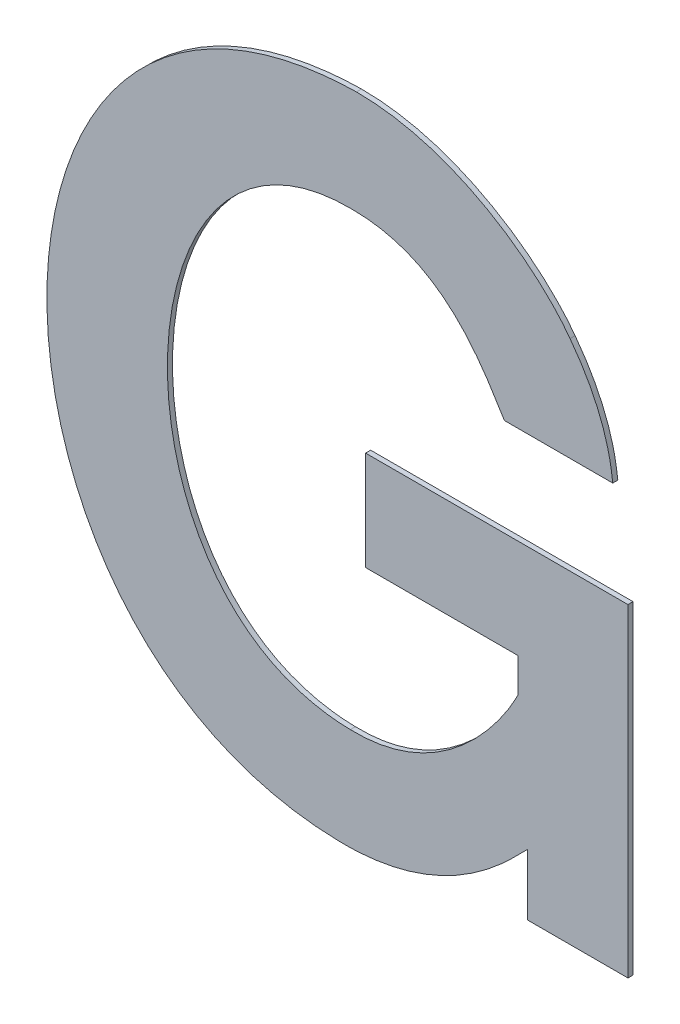
ISO-10303-21;
HEADER;
FILE_DESCRIPTION(('STEP AP214'),'2;1');
FILE_NAME('part.step','',(''),(''),'','','');
FILE_SCHEMA(('AUTOMOTIVE_DESIGN { 1 0 10303 214 1 1 1 1 }'));
ENDSEC;
DATA;
#1=APPLICATION_CONTEXT('core data for automotive mechanical design processes');
#2=APPLICATION_PROTOCOL_DEFINITION('international standard','automotive_design',2000,#1);
#3=PRODUCT_CONTEXT('',#1,'mechanical');
#4=PRODUCT('Part','Part','',(#3));
#5=PRODUCT_RELATED_PRODUCT_CATEGORY('part','',(#4));
#6=PRODUCT_DEFINITION_FORMATION('','',#4);
#7=PRODUCT_DEFINITION_CONTEXT('part definition',#1,'design');
#8=PRODUCT_DEFINITION('design','',#6,#7);
#9=PRODUCT_DEFINITION_SHAPE('','',#8);
#10=(LENGTH_UNIT() NAMED_UNIT(*) SI_UNIT(.MILLI.,.METRE.));
#11=(NAMED_UNIT(*) PLANE_ANGLE_UNIT() SI_UNIT($,.RADIAN.));
#12=(NAMED_UNIT(*) SI_UNIT($,.STERADIAN.) SOLID_ANGLE_UNIT());
#13=UNCERTAINTY_MEASURE_WITH_UNIT(LENGTH_MEASURE(1.E-05),#10,'distance_accuracy_value','');
#14=(GEOMETRIC_REPRESENTATION_CONTEXT(3) GLOBAL_UNCERTAINTY_ASSIGNED_CONTEXT((#13)) GLOBAL_UNIT_ASSIGNED_CONTEXT((#10,
#11,#12)) REPRESENTATION_CONTEXT('',''));
#15=CARTESIAN_POINT('',(0.,0.,0.));
#16=DIRECTION('',(0.,0.,1.));
#17=DIRECTION('',(1.,0.,0.));
#18=AXIS2_PLACEMENT_3D('',#15,#16,#17);
#19=CARTESIAN_POINT('',(-0.0539079148512999,0.042098390387646,0.00086146168299));
#20=DIRECTION('',(-1.,0.,0.));
#21=DIRECTION('',(0.,0.,1.));
#22=AXIS2_PLACEMENT_3D('',#19,#20,#21);
#23=PLANE('',#22);
#24=DIRECTION('',(0.,0.,1.));
#25=VECTOR('',#24,1.);
#26=CARTESIAN_POINT('',(-0.0539079148512999,0.034866638035092,-0.00033853831701));
#27=LINE('',#26,#25);
#28=CARTESIAN_POINT('',(-0.0539079148512999,0.034866638035092,-0.00033853831701));
#29=VERTEX_POINT('',#28);
#30=CARTESIAN_POINT('',(-0.0539079148512999,0.034866638035092,0.00086146168299));
#31=VERTEX_POINT('',#30);
#32=EDGE_CURVE('E11',#29,#31,#27,.T.);
#33=ORIENTED_EDGE('',*,*,#32,.T.);
#34=DIRECTION('',(0.,1.,0.));
#35=VECTOR('',#34,1.);
#36=CARTESIAN_POINT('',(-0.0539079148512999,0.034866638035092,0.00086146168299));
#37=LINE('',#36,#35);
#38=CARTESIAN_POINT('',(-0.0539079148512999,0.0493301427402,0.00086146168299));
#39=VERTEX_POINT('',#38);
#40=EDGE_CURVE('E24',#31,#39,#37,.T.);
#41=ORIENTED_EDGE('',*,*,#40,.T.);
#42=DIRECTION('',(0.,0.,1.));
#43=VECTOR('',#42,1.);
#44=CARTESIAN_POINT('',(-0.0539079148512999,0.0493301427402,-0.00033853831701));
#45=LINE('',#44,#43);
#46=CARTESIAN_POINT('',(-0.0539079148512999,0.0493301427402,-0.00033853831701));
#47=VERTEX_POINT('',#46);
#48=EDGE_CURVE('E348',#47,#39,#45,.T.);
#49=ORIENTED_EDGE('',*,*,#48,.F.);
#50=DIRECTION('',(0.,1.,0.));
#51=VECTOR('',#50,1.);
#52=CARTESIAN_POINT('',(-0.0539079148512999,0.034866638035092,-0.00033853831701));
#53=LINE('',#52,#51);
#54=EDGE_CURVE('E343',#29,#47,#53,.T.);
#55=ORIENTED_EDGE('',*,*,#54,.F.);
#56=EDGE_LOOP('',(#33,#41,#49,#55));
#57=FACE_BOUND('',#56,.T.);
#58=ADVANCED_FACE('F17',(#57),#23,.T.);
#59=CARTESIAN_POINT('',(-0.0539079148512999,0.0493301427402,0.00086146168299));
#60=CARTESIAN_POINT('',(-0.0539079148512999,0.0493301427402,-0.00057853831701));
#61=CARTESIAN_POINT('',(-0.0571591147701,0.046445967167832,0.00086146168299));
#62=CARTESIAN_POINT('',(-0.0571591147701,0.046445967167832,-0.00057853831701));
#63=CARTESIAN_POINT('',(-0.0716522415189,0.027979874118372,0.00086146168299));
#64=CARTESIAN_POINT('',(-0.0716522415189,0.027979874118372,-0.00057853831701));
#65=CARTESIAN_POINT('',(-0.0987961483961,0.028711032855648,0.00086146168299));
#66=CARTESIAN_POINT('',(-0.0987961483961,0.028711032855648,-0.00057853831701));
#67=B_SPLINE_SURFACE_WITH_KNOTS('',3,1,((#59,#60),(#61,#62),(#63,#64),(#65,#66)),.UNSPECIFIED.,
.F.,.F.,.F.,(4,4),(2,2),(0.,1.),(0.,0.00036),.UNSPECIFIED.);
#68=CARTESIAN_POINT('',(-0.0539079148512999,0.0493301427402,0.00086146168299));
#69=CARTESIAN_POINT('',(-0.0571591147701,0.046445967167832,0.00086146168299));
#70=CARTESIAN_POINT('',(-0.0716522415189,0.027979874118372,0.00086146168299));
#71=CARTESIAN_POINT('',(-0.0987961483961,0.028711032855648,0.00086146168299));
#72=B_SPLINE_CURVE_WITH_KNOTS('',3,(#68,#69,#70,#71),.UNSPECIFIED.,.F.,.F.,(4,4),(0.,1.),.UNSPECIFIED.);
#73=CARTESIAN_POINT('',(-0.0987961483961,0.028711032855648,0.00086146168299));
#74=VERTEX_POINT('',#73);
#75=EDGE_CURVE('E339',#39,#74,#72,.T.);
#76=DIRECTION('',(0.,0.,1.));
#77=VECTOR('',#76,1.);
#78=CARTESIAN_POINT('',(-0.0987961483961,0.028711032855648,-0.00033853831701));
#79=LINE('',#78,#77);
#80=CARTESIAN_POINT('',(-0.0987961483961,0.028711032855648,-0.00033853831701));
#81=VERTEX_POINT('',#80);
#82=EDGE_CURVE('E333',#81,#74,#79,.T.);
#83=CARTESIAN_POINT('',(-0.0539079148512999,0.0493301427402,-0.00033853831701));
#84=CARTESIAN_POINT('',(-0.0571591147701,0.046445967167832,-0.00033853831701));
#85=CARTESIAN_POINT('',(-0.0716522415189,0.027979874118372,-0.00033853831701));
#86=CARTESIAN_POINT('',(-0.0987961483961,0.028711032855648,-0.00033853831701));
#87=B_SPLINE_CURVE_WITH_KNOTS('',3,(#83,#84,#85,#86),.UNSPECIFIED.,.F.,.F.,(4,4),(0.,1.),.UNSPECIFIED.);
#88=EDGE_CURVE('E325',#47,#81,#87,.T.);
#89=ORIENTED_EDGE('',*,*,#48,.T.);
#90=ORIENTED_EDGE('',*,*,#75,.T.);
#91=ORIENTED_EDGE('',*,*,#82,.F.);
#92=ORIENTED_EDGE('',*,*,#88,.F.);
#93=EDGE_LOOP('',(#89,#90,#91,#92));
#94=FACE_BOUND('',#93,.T.);
#95=ADVANCED_FACE('F354',(#94),#67,.T.);
#96=CARTESIAN_POINT('',(-0.0987961483961,0.028711032855648,0.00086146168299));
#97=CARTESIAN_POINT('',(-0.0987961483961,0.028711032855648,-0.00057853831701));
#98=CARTESIAN_POINT('',(-0.1914264465245,0.030881389423612,0.00086146168299));
#99=CARTESIAN_POINT('',(-0.1914264465245,0.030881389423612,-0.00057853831701));
#100=CARTESIAN_POINT('',(-0.1918093656261,0.1828807655346,0.00086146168299));
#101=CARTESIAN_POINT('',(-0.1918093656261,0.1828807655346,-0.00057853831701));
#102=CARTESIAN_POINT('',(-0.0944395405048999,0.184697825045,0.00086146168299));
#103=CARTESIAN_POINT('',(-0.0944395405048999,0.184697825045,-0.00057853831701));
#104=B_SPLINE_SURFACE_WITH_KNOTS('',3,1,((#96,#97),(#98,#99),(#100,#101),(#102,#103)),
.UNSPECIFIED.,.F.,.F.,.F.,(4,4),(2,2),(0.,1.),(0.,0.00036),.UNSPECIFIED.);
#105=CARTESIAN_POINT('',(-0.0987961483961,0.028711032855648,0.00086146168299));
#106=CARTESIAN_POINT('',(-0.1914264465245,0.030881389423612,0.00086146168299));
#107=CARTESIAN_POINT('',(-0.1918093656261,0.1828807655346,0.00086146168299));
#108=CARTESIAN_POINT('',(-0.0944395405048999,0.184697825045,0.00086146168299));
#109=B_SPLINE_CURVE_WITH_KNOTS('',3,(#105,#106,#107,#108),.UNSPECIFIED.,.F.,.F.,(4,4),(0.,1.),.UNSPECIFIED.);
#110=CARTESIAN_POINT('',(-0.0944395405048999,0.184697825045,0.00086146168299));
#111=VERTEX_POINT('',#110);
#112=EDGE_CURVE('E321',#74,#111,#109,.T.);
#113=DIRECTION('',(0.,0.,1.));
#114=VECTOR('',#113,1.);
#115=CARTESIAN_POINT('',(-0.0944395405048999,0.184697825045,-0.00033853831701));
#116=LINE('',#115,#114);
#117=CARTESIAN_POINT('',(-0.0944395405048999,0.184697825045,-0.00033853831701));
#118=VERTEX_POINT('',#117);
#119=EDGE_CURVE('E315',#118,#111,#116,.T.);
#120=CARTESIAN_POINT('',(-0.0987961483961,0.028711032855648,-0.00033853831701));
#121=CARTESIAN_POINT('',(-0.1914264465245,0.030881389423612,-0.00033853831701));
#122=CARTESIAN_POINT('',(-0.1918093656261,0.1828807655346,-0.00033853831701));
#123=CARTESIAN_POINT('',(-0.0944395405048999,0.184697825045,-0.00033853831701));
#124=B_SPLINE_CURVE_WITH_KNOTS('',3,(#120,#121,#122,#123),.UNSPECIFIED.,.F.,.F.,(4,4),(0.,1.),.UNSPECIFIED.);
#125=EDGE_CURVE('E307',#81,#118,#124,.T.);
#126=ORIENTED_EDGE('',*,*,#82,.T.);
#127=ORIENTED_EDGE('',*,*,#112,.T.);
#128=ORIENTED_EDGE('',*,*,#119,.F.);
#129=ORIENTED_EDGE('',*,*,#125,.F.);
#130=EDGE_LOOP('',(#126,#127,#128,#129));
#131=FACE_BOUND('',#130,.T.);
#132=ADVANCED_FACE('F360',(#131),#104,.T.);
#133=CARTESIAN_POINT('',(-0.0944395405048999,0.184697825045,0.00086146168299));
#134=CARTESIAN_POINT('',(-0.0944395405048999,0.184697825045,-0.00057853831701));
#135=CARTESIAN_POINT('',(-0.0709369775369,0.184697825045,0.00086146168299));
#136=CARTESIAN_POINT('',(-0.0709369775369,0.184697825045,-0.00057853831701));
#137=CARTESIAN_POINT('',(-0.0513864286921,0.169853568705,0.00086146168299));
#138=CARTESIAN_POINT('',(-0.0513864286921,0.169853568705,-0.00057853831701));
#139=CARTESIAN_POINT('',(-0.0437786208825,0.159360140345,0.00086146168299));
#140=CARTESIAN_POINT('',(-0.0437786208825,0.159360140345,-0.00057853831701));
#141=B_SPLINE_SURFACE_WITH_KNOTS('',3,1,((#133,#134),(#135,#136),(#137,#138),(#139,#140)),
.UNSPECIFIED.,.F.,.F.,.F.,(4,4),(2,2),(0.,1.),(0.,0.00036),.UNSPECIFIED.);
#142=CARTESIAN_POINT('',(-0.0944395405048999,0.184697825045,0.00086146168299));
#143=CARTESIAN_POINT('',(-0.0709369775369,0.184697825045,0.00086146168299));
#144=CARTESIAN_POINT('',(-0.0513864286921,0.169853568705,0.00086146168299));
#145=CARTESIAN_POINT('',(-0.0437786208825,0.159360140345,0.00086146168299));
#146=B_SPLINE_CURVE_WITH_KNOTS('',3,(#142,#143,#144,#145),.UNSPECIFIED.,.F.,.F.,(4,4),(0.,1.),.UNSPECIFIED.);
#147=CARTESIAN_POINT('',(-0.0437786208825,0.159360140345,0.00086146168299));
#148=VERTEX_POINT('',#147);
#149=EDGE_CURVE('E303',#111,#148,#146,.T.);
#150=DIRECTION('',(0.,0.,1.));
#151=VECTOR('',#150,1.);
#152=CARTESIAN_POINT('',(-0.0437786208825,0.159360140345,-0.00033853831701));
#153=LINE('',#152,#151);
#154=CARTESIAN_POINT('',(-0.0437786208825,0.159360140345,-0.00033853831701));
#155=VERTEX_POINT('',#154);
#156=EDGE_CURVE('E297',#155,#148,#153,.T.);
#157=CARTESIAN_POINT('',(-0.0944395405048999,0.184697825045,-0.00033853831701));
#158=CARTESIAN_POINT('',(-0.0709369775369,0.184697825045,-0.00033853831701));
#159=CARTESIAN_POINT('',(-0.0513864286921,0.169853568705,-0.00033853831701));
#160=CARTESIAN_POINT('',(-0.0437786208825,0.159360140345,-0.00033853831701));
#161=B_SPLINE_CURVE_WITH_KNOTS('',3,(#157,#158,#159,#160),.UNSPECIFIED.,.F.,.F.,(4,4),(0.,1.),.UNSPECIFIED.);
#162=EDGE_CURVE('E289',#118,#155,#161,.T.);
#163=ORIENTED_EDGE('',*,*,#119,.T.);
#164=ORIENTED_EDGE('',*,*,#149,.T.);
#165=ORIENTED_EDGE('',*,*,#156,.F.);
#166=ORIENTED_EDGE('',*,*,#162,.F.);
#167=EDGE_LOOP('',(#163,#164,#165,#166));
#168=FACE_BOUND('',#167,.T.);
#169=ADVANCED_FACE('F364',(#168),#141,.T.);
#170=CARTESIAN_POINT('',(-0.0437786208825,0.159360140345,0.00086146168299));
#171=CARTESIAN_POINT('',(-0.0437786208825,0.159360140345,-0.00057853831701));
#172=CARTESIAN_POINT('',(-0.0347258353309,0.1474166768214,0.00086146168299));
#173=CARTESIAN_POINT('',(-0.0347258353309,0.1474166768214,-0.00057853831701));
#174=CARTESIAN_POINT('',(-0.0340033464600999,0.1372765455194,0.00086146168299));
#175=CARTESIAN_POINT('',(-0.0340033464600999,0.1372765455194,-0.00057853831701));
#176=CARTESIAN_POINT('',(-0.0336421020249,0.134739164605,0.00086146168299));
#177=CARTESIAN_POINT('',(-0.0336421020249,0.134739164605,-0.00057853831701));
#178=B_SPLINE_SURFACE_WITH_KNOTS('',3,1,((#170,#171),(#172,#173),(#174,#175),(#176,#177)),
.UNSPECIFIED.,.F.,.F.,.F.,(4,4),(2,2),(0.,1.),(0.,0.00036),.UNSPECIFIED.);
#179=CARTESIAN_POINT('',(-0.0437786208825,0.159360140345,0.00086146168299));
#180=CARTESIAN_POINT('',(-0.0347258353309,0.1474166768214,0.00086146168299));
#181=CARTESIAN_POINT('',(-0.0340033464600999,0.1372765455194,0.00086146168299));
#182=CARTESIAN_POINT('',(-0.0336421020249,0.134739164605,0.00086146168299));
#183=B_SPLINE_CURVE_WITH_KNOTS('',3,(#179,#180,#181,#182),.UNSPECIFIED.,.F.,.F.,(4,4),(0.,1.),.UNSPECIFIED.);
#184=CARTESIAN_POINT('',(-0.0336421020249,0.134739164605,0.00086146168299));
#185=VERTEX_POINT('',#184);
#186=EDGE_CURVE('E285',#148,#185,#183,.T.);
#187=DIRECTION('',(0.,0.,1.));
#188=VECTOR('',#187,1.);
#189=CARTESIAN_POINT('',(-0.0336421020249,0.134739164605,-0.00033853831701));
#190=LINE('',#189,#188);
#191=CARTESIAN_POINT('',(-0.0336421020249,0.134739164605,-0.00033853831701));
#192=VERTEX_POINT('',#191);
#193=EDGE_CURVE('E279',#192,#185,#190,.T.);
#194=CARTESIAN_POINT('',(-0.0437786208825,0.159360140345,-0.00033853831701));
#195=CARTESIAN_POINT('',(-0.0347258353309,0.1474166768214,-0.00033853831701));
#196=CARTESIAN_POINT('',(-0.0340033464600999,0.1372765455194,-0.00033853831701));
#197=CARTESIAN_POINT('',(-0.0336421020249,0.134739164605,-0.00033853831701));
#198=B_SPLINE_CURVE_WITH_KNOTS('',3,(#194,#195,#196,#197),.UNSPECIFIED.,.F.,.F.,(4,4),(0.,1.),.UNSPECIFIED.);
#199=EDGE_CURVE('E274',#155,#192,#198,.T.);
#200=ORIENTED_EDGE('',*,*,#156,.T.);
#201=ORIENTED_EDGE('',*,*,#186,.T.);
#202=ORIENTED_EDGE('',*,*,#193,.F.);
#203=ORIENTED_EDGE('',*,*,#199,.F.);
#204=EDGE_LOOP('',(#200,#201,#202,#203));
#205=FACE_BOUND('',#204,.T.);
#206=ADVANCED_FACE('F368',(#205),#178,.T.);
#207=CARTESIAN_POINT('',(-0.0464915665925,0.134739164605,0.00086146168299));
#208=DIRECTION('',(0.,-1.,0.));
#209=DIRECTION('',(0.,0.,-1.));
#210=AXIS2_PLACEMENT_3D('',#207,#208,#209);
#211=PLANE('',#210);
#212=ORIENTED_EDGE('',*,*,#193,.T.);
#213=DIRECTION('',(-1.,0.,0.));
#214=VECTOR('',#213,1.);
#215=CARTESIAN_POINT('',(-0.0336421020249,0.134739164605,0.00086146168299));
#216=LINE('',#215,#214);
#217=CARTESIAN_POINT('',(-0.0593410311601,0.134739164605,0.00086146168299));
#218=VERTEX_POINT('',#217);
#219=EDGE_CURVE('E272',#185,#218,#216,.T.);
#220=ORIENTED_EDGE('',*,*,#219,.T.);
#221=DIRECTION('',(0.,0.,1.));
#222=VECTOR('',#221,1.);
#223=CARTESIAN_POINT('',(-0.0593410311601,0.134739164605,-0.00033853831701));
#224=LINE('',#223,#222);
#225=CARTESIAN_POINT('',(-0.0593410311601,0.134739164605,-0.00033853831701));
#226=VERTEX_POINT('',#225);
#227=EDGE_CURVE('E269',#226,#218,#224,.T.);
#228=ORIENTED_EDGE('',*,*,#227,.F.);
#229=DIRECTION('',(-1.,0.,0.));
#230=VECTOR('',#229,1.);
#231=CARTESIAN_POINT('',(-0.0336421020249,0.134739164605,-0.00033853831701));
#232=LINE('',#231,#230);
#233=EDGE_CURVE('E263',#192,#226,#232,.T.);
#234=ORIENTED_EDGE('',*,*,#233,.F.);
#235=EDGE_LOOP('',(#212,#220,#228,#234));
#236=FACE_BOUND('',#235,.T.);
#237=ADVANCED_FACE('F371',(#236),#211,.T.);
#238=CARTESIAN_POINT('',(-0.0593410311601,0.134739164605,0.00086146168299));
#239=CARTESIAN_POINT('',(-0.0593410311601,0.134739164605,-0.00057853831701));
#240=CARTESIAN_POINT('',(-0.0651353919041001,0.1441654769026,0.00086146168299));
#241=CARTESIAN_POINT('',(-0.0651353919041001,0.1441654769026,-0.00057853831701));
#242=CARTESIAN_POINT('',(-0.0741881774556999,0.1600797392602,0.00086146168299));
#243=CARTESIAN_POINT('',(-0.0741881774556999,0.1600797392602,-0.00057853831701));
#244=CARTESIAN_POINT('',(-0.0955232738108999,0.1600797392602,0.00086146168299));
#245=CARTESIAN_POINT('',(-0.0955232738108999,0.1600797392602,-0.00057853831701));
#246=B_SPLINE_SURFACE_WITH_KNOTS('',3,1,((#238,#239),(#240,#241),(#242,#243),(#244,#245)),
.UNSPECIFIED.,.F.,.F.,.F.,(4,4),(2,2),(0.,1.),(0.,0.00036),.UNSPECIFIED.);
#247=CARTESIAN_POINT('',(-0.0593410311601,0.134739164605,0.00086146168299));
#248=CARTESIAN_POINT('',(-0.0651353919041001,0.1441654769026,0.00086146168299));
#249=CARTESIAN_POINT('',(-0.0741881774556999,0.1600797392602,0.00086146168299));
#250=CARTESIAN_POINT('',(-0.0955232738108999,0.1600797392602,0.00086146168299));
#251=B_SPLINE_CURVE_WITH_KNOTS('',3,(#247,#248,#249,#250),.UNSPECIFIED.,.F.,.F.,(4,4),(0.,1.),.UNSPECIFIED.);
#252=CARTESIAN_POINT('',(-0.0955232738108999,0.1600797392602,0.00086146168299));
#253=VERTEX_POINT('',#252);
#254=EDGE_CURVE('E259',#218,#253,#251,.T.);
#255=DIRECTION('',(0.,0.,1.));
#256=VECTOR('',#255,1.);
#257=CARTESIAN_POINT('',(-0.0955232738108999,0.1600797392602,-0.00033853831701));
#258=LINE('',#257,#256);
#259=CARTESIAN_POINT('',(-0.0955232738108999,0.1600797392602,-0.00033853831701));
#260=VERTEX_POINT('',#259);
#261=EDGE_CURVE('E253',#260,#253,#258,.T.);
#262=CARTESIAN_POINT('',(-0.0593410311601,0.134739164605,-0.00033853831701));
#263=CARTESIAN_POINT('',(-0.0651353919041001,0.1441654769026,-0.00033853831701));
#264=CARTESIAN_POINT('',(-0.0741881774556999,0.1600797392602,-0.00033853831701));
#265=CARTESIAN_POINT('',(-0.0955232738108999,0.1600797392602,-0.00033853831701));
#266=B_SPLINE_CURVE_WITH_KNOTS('',3,(#262,#263,#264,#265),.UNSPECIFIED.,.F.,.F.,(4,4),(0.,1.),.UNSPECIFIED.);
#267=EDGE_CURVE('E248',#226,#260,#266,.T.);
#268=ORIENTED_EDGE('',*,*,#227,.T.);
#269=ORIENTED_EDGE('',*,*,#254,.T.);
#270=ORIENTED_EDGE('',*,*,#261,.F.);
#271=ORIENTED_EDGE('',*,*,#267,.F.);
#272=EDGE_LOOP('',(#268,#269,#270,#271));
#273=FACE_BOUND('',#272,.T.);
#274=ADVANCED_FACE('F375',(#273),#246,.T.);
#275=CARTESIAN_POINT('',(-0.0955232738108999,0.1600797392602,0.00086146168299));
#276=CARTESIAN_POINT('',(-0.0955232738108999,0.1600797392602,-0.00057853831701));
#277=CARTESIAN_POINT('',(-0.1519930039549,0.1607964482202,0.00086146168299));
#278=CARTESIAN_POINT('',(-0.1519930039549,0.1607964482202,-0.00057853831701));
#279=CARTESIAN_POINT('',(-0.1555982234205,0.054034990267,0.00086146168299));
#280=CARTESIAN_POINT('',(-0.1555982234205,0.054034990267,-0.00057853831701));
#281=CARTESIAN_POINT('',(-0.0958917431353,0.0529649842494,0.00086146168299));
#282=CARTESIAN_POINT('',(-0.0958917431353,0.0529649842494,-0.00057853831701));
#283=B_SPLINE_SURFACE_WITH_KNOTS('',3,1,((#275,#276),(#277,#278),(#279,#280),(#281,#282)),
.UNSPECIFIED.,.F.,.F.,.F.,(4,4),(2,2),(0.,1.),(0.,0.00036),.UNSPECIFIED.);
#284=CARTESIAN_POINT('',(-0.0955232738108999,0.1600797392602,0.00086146168299));
#285=CARTESIAN_POINT('',(-0.1519930039549,0.1607964482202,0.00086146168299));
#286=CARTESIAN_POINT('',(-0.1555982234205,0.054034990267,0.00086146168299));
#287=CARTESIAN_POINT('',(-0.0958917431353,0.0529649842494,0.00086146168299));
#288=B_SPLINE_CURVE_WITH_KNOTS('',3,(#284,#285,#286,#287),.UNSPECIFIED.,.F.,.F.,(4,4),(0.,1.),.UNSPECIFIED.);
#289=CARTESIAN_POINT('',(-0.0958917431353,0.0529649842494,0.00086146168299));
#290=VERTEX_POINT('',#289);
#291=EDGE_CURVE('E239',#253,#290,#288,.T.);
#292=DIRECTION('',(0.,0.,1.));
#293=VECTOR('',#292,1.);
#294=CARTESIAN_POINT('',(-0.0958917431353,0.0529649842494,-0.00033853831701));
#295=LINE('',#294,#293);
#296=CARTESIAN_POINT('',(-0.0958917431353,0.0529649842494,-0.00033853831701));
#297=VERTEX_POINT('',#296);
#298=EDGE_CURVE('E235',#297,#290,#295,.T.);
#299=CARTESIAN_POINT('',(-0.0955232738108999,0.1600797392602,-0.00033853831701));
#300=CARTESIAN_POINT('',(-0.1519930039549,0.1607964482202,-0.00033853831701));
#301=CARTESIAN_POINT('',(-0.1555982234205,0.054034990267,-0.00033853831701));
#302=CARTESIAN_POINT('',(-0.0958917431353,0.0529649842494,-0.00033853831701));
#303=B_SPLINE_CURVE_WITH_KNOTS('',3,(#299,#300,#301,#302),.UNSPECIFIED.,.F.,.F.,(4,4),(0.,1.),.UNSPECIFIED.);
#304=EDGE_CURVE('E229',#260,#297,#303,.T.);
#305=ORIENTED_EDGE('',*,*,#261,.T.);
#306=ORIENTED_EDGE('',*,*,#291,.T.);
#307=ORIENTED_EDGE('',*,*,#298,.F.);
#308=ORIENTED_EDGE('',*,*,#304,.F.);
#309=EDGE_LOOP('',(#305,#306,#307,#308));
#310=FACE_BOUND('',#309,.T.);
#311=ADVANCED_FACE('F197',(#310),#283,.T.);
#312=CARTESIAN_POINT('',(-0.0958917431353,0.0529649842494,0.00086146168299));
#313=CARTESIAN_POINT('',(-0.0958917431353,0.0529649842494,-0.00057853831701));
#314=CARTESIAN_POINT('',(-0.0694703251289,0.0522482752894,0.00086146168299));
#315=CARTESIAN_POINT('',(-0.0694703251289,0.0522482752894,-0.00057853831701));
#316=CARTESIAN_POINT('',(-0.0560898312412999,0.0797396993134,0.00086146168299));
#317=CARTESIAN_POINT('',(-0.0560898312412999,0.0797396993134,-0.00057853831701));
#318=CARTESIAN_POINT('',(-0.0560898312412999,0.0800922738822,0.00086146168299));
#319=CARTESIAN_POINT('',(-0.0560898312412999,0.0800922738822,-0.00057853831701));
#320=B_SPLINE_SURFACE_WITH_KNOTS('',3,1,((#312,#313),(#314,#315),(#316,#317),(#318,#319)),
.UNSPECIFIED.,.F.,.F.,.F.,(4,4),(2,2),(0.,1.),(0.,0.00036),.UNSPECIFIED.);
#321=CARTESIAN_POINT('',(-0.0958917431353,0.0529649842494,0.00086146168299));
#322=CARTESIAN_POINT('',(-0.0694703251289,0.0522482752894,0.00086146168299));
#323=CARTESIAN_POINT('',(-0.0560898312412999,0.0797396993134,0.00086146168299));
#324=CARTESIAN_POINT('',(-0.0560898312412999,0.0800922738822,0.00086146168299));
#325=B_SPLINE_CURVE_WITH_KNOTS('',3,(#321,#322,#323,#324),.UNSPECIFIED.,.F.,.F.,(4,4),(0.,1.),.UNSPECIFIED.);
#326=CARTESIAN_POINT('',(-0.0560898312412999,0.0800922738822,0.00086146168299));
#327=VERTEX_POINT('',#326);
#328=EDGE_CURVE('E223',#290,#327,#325,.T.);
#329=DIRECTION('',(0.,0.,1.));
#330=VECTOR('',#329,1.);
#331=CARTESIAN_POINT('',(-0.0560898312412999,0.0800922738822,-0.00033853831701));
#332=LINE('',#331,#330);
#333=CARTESIAN_POINT('',(-0.0560898312412999,0.0800922738822,-0.00033853831701));
#334=VERTEX_POINT('',#333);
#335=EDGE_CURVE('E382',#334,#327,#332,.T.);
#336=CARTESIAN_POINT('',(-0.0560898312412999,0.0800922738822,-0.00033853831701));
#337=CARTESIAN_POINT('',(-0.0560898312412999,0.0797396993134,-0.00033853831701));
#338=CARTESIAN_POINT('',(-0.0694703251289,0.0522482752894,-0.00033853831701));
#339=CARTESIAN_POINT('',(-0.0958917431353,0.0529649842494,-0.00033853831701));
#340=B_SPLINE_CURVE_WITH_KNOTS('',3,(#336,#337,#338,#339),.UNSPECIFIED.,.F.,.F.,(4,4),(0.,1.),.UNSPECIFIED.);
#341=EDGE_CURVE('E177',#297,#334,#340,.F.);
#342=ORIENTED_EDGE('',*,*,#298,.T.);
#343=ORIENTED_EDGE('',*,*,#328,.T.);
#344=ORIENTED_EDGE('',*,*,#335,.F.);
#345=ORIENTED_EDGE('',*,*,#341,.F.);
#346=EDGE_LOOP('',(#342,#343,#344,#345));
#347=FACE_BOUND('',#346,.T.);
#348=ADVANCED_FACE('F184',(#347),#320,.T.);
#349=CARTESIAN_POINT('',(-0.0560898312412999,0.084078606227,0.00086146168299));
#350=DIRECTION('',(-1.,0.,0.));
#351=DIRECTION('',(0.,0.,1.));
#352=AXIS2_PLACEMENT_3D('',#349,#350,#351);
#353=PLANE('',#352);
#354=ORIENTED_EDGE('',*,*,#335,.T.);
#355=DIRECTION('',(0.,1.,0.));
#356=VECTOR('',#355,1.);
#357=CARTESIAN_POINT('',(-0.0560898312412999,0.0800922738822,0.00086146168299));
#358=LINE('',#357,#356);
#359=CARTESIAN_POINT('',(-0.0560898312412999,0.0880649385718,0.00086146168299));
#360=VERTEX_POINT('',#359);
#361=EDGE_CURVE('E173',#327,#360,#358,.T.);
#362=ORIENTED_EDGE('',*,*,#361,.T.);
#363=DIRECTION('',(0.,0.,1.));
#364=VECTOR('',#363,1.);
#365=CARTESIAN_POINT('',(-0.0560898312412999,0.0880649385718,-0.00033853831701));
#366=LINE('',#365,#364);
#367=CARTESIAN_POINT('',(-0.0560898312412999,0.0880649385718,-0.00033853831701));
#368=VERTEX_POINT('',#367);
#369=EDGE_CURVE('E170',#368,#360,#366,.T.);
#370=ORIENTED_EDGE('',*,*,#369,.F.);
#371=DIRECTION('',(0.,1.,0.));
#372=VECTOR('',#371,1.);
#373=CARTESIAN_POINT('',(-0.0560898312412999,0.0800922738822,-0.00033853831701));
#374=LINE('',#373,#372);
#375=EDGE_CURVE('E165',#334,#368,#374,.T.);
#376=ORIENTED_EDGE('',*,*,#375,.F.);
#377=EDGE_LOOP('',(#354,#362,#370,#376));
#378=FACE_BOUND('',#377,.T.);
#379=ADVANCED_FACE('F196',(#378),#353,.T.);
#380=CARTESIAN_POINT('',(-0.0741809525668999,0.0880649385718,0.00086146168299));
#381=DIRECTION('',(0.,-1.,0.));
#382=DIRECTION('',(0.,0.,-1.));
#383=AXIS2_PLACEMENT_3D('',#380,#381,#382);
#384=PLANE('',#383);
#385=ORIENTED_EDGE('',*,*,#369,.T.);
#386=DIRECTION('',(-1.,0.,0.));
#387=VECTOR('',#386,1.);
#388=CARTESIAN_POINT('',(-0.0560898312412999,0.0880649385718,0.00086146168299));
#389=LINE('',#388,#387);
#390=CARTESIAN_POINT('',(-0.0922720738924999,0.0880649385718,0.00086146168299));
#391=VERTEX_POINT('',#390);
#392=EDGE_CURVE('E163',#360,#391,#389,.T.);
#393=ORIENTED_EDGE('',*,*,#392,.T.);
#394=DIRECTION('',(0.,0.,1.));
#395=VECTOR('',#394,1.);
#396=CARTESIAN_POINT('',(-0.0922720738924999,0.0880649385718,-0.00033853831701));
#397=LINE('',#396,#395);
#398=CARTESIAN_POINT('',(-0.0922720738924999,0.0880649385718,-0.00033853831701));
#399=VERTEX_POINT('',#398);
#400=EDGE_CURVE('E160',#399,#391,#397,.T.);
#401=ORIENTED_EDGE('',*,*,#400,.F.);
#402=DIRECTION('',(-1.,0.,0.));
#403=VECTOR('',#402,1.);
#404=CARTESIAN_POINT('',(-0.0560898312412999,0.0880649385718,-0.00033853831701));
#405=LINE('',#404,#403);
#406=EDGE_CURVE('E157',#368,#399,#405,.T.);
#407=ORIENTED_EDGE('',*,*,#406,.F.);
#408=EDGE_LOOP('',(#385,#393,#401,#407));
#409=FACE_BOUND('',#408,.T.);
#410=ADVANCED_FACE('F419',(#409),#384,.T.);
#411=CARTESIAN_POINT('',(-0.0922720738924999,0.0998252511666,0.00086146168299));
#412=DIRECTION('',(-1.,0.,0.));
#413=DIRECTION('',(0.,0.,1.));
#414=AXIS2_PLACEMENT_3D('',#411,#412,#413);
#415=PLANE('',#414);
#416=ORIENTED_EDGE('',*,*,#400,.T.);
#417=DIRECTION('',(0.,1.,0.));
#418=VECTOR('',#417,1.);
#419=CARTESIAN_POINT('',(-0.0922720738924999,0.0880649385718,0.00086146168299));
#420=LINE('',#419,#418);
#421=CARTESIAN_POINT('',(-0.0922720738924999,0.1115855637614,0.00086146168299));
#422=VERTEX_POINT('',#421);
#423=EDGE_CURVE('E155',#391,#422,#420,.T.);
#424=ORIENTED_EDGE('',*,*,#423,.T.);
#425=DIRECTION('',(0.,0.,1.));
#426=VECTOR('',#425,1.);
#427=CARTESIAN_POINT('',(-0.0922720738924999,0.1115855637614,-0.00033853831701));
#428=LINE('',#427,#426);
#429=CARTESIAN_POINT('',(-0.0922720738924999,0.1115855637614,-0.00033853831701));
#430=VERTEX_POINT('',#429);
#431=EDGE_CURVE('E152',#430,#422,#428,.T.);
#432=ORIENTED_EDGE('',*,*,#431,.F.);
#433=DIRECTION('',(0.,1.,0.));
#434=VECTOR('',#433,1.);
#435=CARTESIAN_POINT('',(-0.0922720738924999,0.0880649385718,-0.00033853831701));
#436=LINE('',#435,#434);
#437=EDGE_CURVE('E150',#399,#430,#436,.T.);
#438=ORIENTED_EDGE('',*,*,#437,.F.);
#439=EDGE_LOOP('',(#416,#424,#432,#438));
#440=FACE_BOUND('',#439,.T.);
#441=ADVANCED_FACE('F416',(#440),#415,.T.);
#442=CARTESIAN_POINT('',(-0.0611544782259,0.1115855637614,0.00086146168299));
#443=DIRECTION('',(0.,1.,0.));
#444=DIRECTION('',(0.,0.,1.));
#445=AXIS2_PLACEMENT_3D('',#442,#443,#444);
#446=PLANE('',#445);
#447=ORIENTED_EDGE('',*,*,#431,.T.);
#448=DIRECTION('',(1.,0.,0.));
#449=VECTOR('',#448,1.);
#450=CARTESIAN_POINT('',(-0.0922720738924999,0.1115855637614,0.00086146168299));
#451=LINE('',#450,#449);
#452=CARTESIAN_POINT('',(-0.0300368825593,0.1115855637614,0.00086146168299));
#453=VERTEX_POINT('',#452);
#454=EDGE_CURVE('E148',#422,#453,#451,.T.);
#455=ORIENTED_EDGE('',*,*,#454,.T.);
#456=DIRECTION('',(0.,0.,1.));
#457=VECTOR('',#456,1.);
#458=CARTESIAN_POINT('',(-0.0300368825593,0.1115855637614,-0.00033853831701));
#459=LINE('',#458,#457);
#460=CARTESIAN_POINT('',(-0.0300368825593,0.1115855637614,-0.00033853831701));
#461=VERTEX_POINT('',#460);
#462=EDGE_CURVE('E146',#461,#453,#459,.T.);
#463=ORIENTED_EDGE('',*,*,#462,.F.);
#464=DIRECTION('',(1.,0.,0.));
#465=VECTOR('',#464,1.);
#466=CARTESIAN_POINT('',(-0.0922720738924999,0.1115855637614,-0.00033853831701));
#467=LINE('',#466,#465);
#468=EDGE_CURVE('E137',#430,#461,#467,.T.);
#469=ORIENTED_EDGE('',*,*,#468,.F.);
#470=EDGE_LOOP('',(#447,#455,#463,#469));
#471=FACE_BOUND('',#470,.T.);
#472=ADVANCED_FACE('F413',(#471),#446,.T.);
#473=CARTESIAN_POINT('',(-0.0300368825593,0.073226100898246,0.00086146168299));
#474=DIRECTION('',(1.,0.,0.));
#475=DIRECTION('',(0.,0.,-1.));
#476=AXIS2_PLACEMENT_3D('',#473,#474,#475);
#477=PLANE('',#476);
#478=ORIENTED_EDGE('',*,*,#462,.T.);
#479=DIRECTION('',(0.,-1.,0.));
#480=VECTOR('',#479,1.);
#481=CARTESIAN_POINT('',(-0.0300368825593,0.1115855637614,0.00086146168299));
#482=LINE('',#481,#480);
#483=CARTESIAN_POINT('',(-0.0300368825593,0.034866638035092,0.00086146168299));
#484=VERTEX_POINT('',#483);
#485=EDGE_CURVE('E126',#453,#484,#482,.T.);
#486=ORIENTED_EDGE('',*,*,#485,.T.);
#487=DIRECTION('',(0.,0.,1.));
#488=VECTOR('',#487,1.);
#489=CARTESIAN_POINT('',(-0.0300368825593,0.034866638035092,-0.00033853831701));
#490=LINE('',#489,#488);
#491=CARTESIAN_POINT('',(-0.0300368825593,0.034866638035092,-0.00033853831701));
#492=VERTEX_POINT('',#491);
#493=EDGE_CURVE('E120',#492,#484,#490,.T.);
#494=ORIENTED_EDGE('',*,*,#493,.F.);
#495=DIRECTION('',(0.,-1.,0.));
#496=VECTOR('',#495,1.);
#497=CARTESIAN_POINT('',(-0.0300368825593,0.1115855637614,-0.00033853831701));
#498=LINE('',#497,#496);
#499=EDGE_CURVE('E124',#461,#492,#498,.T.);
#500=ORIENTED_EDGE('',*,*,#499,.F.);
#501=EDGE_LOOP('',(#478,#486,#494,#500));
#502=FACE_BOUND('',#501,.T.);
#503=ADVANCED_FACE('F123',(#502),#477,.T.);
#504=CARTESIAN_POINT('',(-0.0419723987052999,0.034866638035092,0.00086146168299));
#505=DIRECTION('',(0.,-1.,0.));
#506=DIRECTION('',(0.,0.,-1.));
#507=AXIS2_PLACEMENT_3D('',#504,#505,#506);
#508=PLANE('',#507);
#509=ORIENTED_EDGE('',*,*,#493,.T.);
#510=DIRECTION('',(-1.,0.,0.));
#511=VECTOR('',#510,1.);
#512=CARTESIAN_POINT('',(-0.0300368825593,0.034866638035092,0.00086146168299));
#513=LINE('',#512,#511);
#514=EDGE_CURVE('E138',#484,#31,#513,.T.);
#515=ORIENTED_EDGE('',*,*,#514,.T.);
#516=ORIENTED_EDGE('',*,*,#32,.F.);
#517=DIRECTION('',(-1.,0.,0.));
#518=VECTOR('',#517,1.);
#519=CARTESIAN_POINT('',(-0.0300368825593,0.034866638035092,-0.00033853831701));
#520=LINE('',#519,#518);
#521=EDGE_CURVE('E134',#492,#29,#520,.T.);
#522=ORIENTED_EDGE('',*,*,#521,.F.);
#523=EDGE_LOOP('',(#509,#515,#516,#522));
#524=FACE_BOUND('',#523,.T.);
#525=ADVANCED_FACE('F140',(#524),#508,.T.);
#526=CARTESIAN_POINT('',(-0.1109231240927,0.027979874118372,-0.00033853831701));
#527=DIRECTION('',(0.,0.,1.));
#528=DIRECTION('',(1.,0.,0.));
#529=AXIS2_PLACEMENT_3D('',#526,#527,#528);
#530=PLANE('',#529);
#531=ORIENTED_EDGE('',*,*,#54,.T.);
#532=ORIENTED_EDGE('',*,*,#88,.T.);
#533=ORIENTED_EDGE('',*,*,#125,.T.);
#534=ORIENTED_EDGE('',*,*,#162,.T.);
#535=ORIENTED_EDGE('',*,*,#199,.T.);
#536=ORIENTED_EDGE('',*,*,#233,.T.);
#537=ORIENTED_EDGE('',*,*,#267,.T.);
#538=ORIENTED_EDGE('',*,*,#304,.T.);
#539=ORIENTED_EDGE('',*,*,#341,.T.);
#540=ORIENTED_EDGE('',*,*,#375,.T.);
#541=ORIENTED_EDGE('',*,*,#406,.T.);
#542=ORIENTED_EDGE('',*,*,#437,.T.);
#543=ORIENTED_EDGE('',*,*,#468,.T.);
#544=ORIENTED_EDGE('',*,*,#499,.T.);
#545=ORIENTED_EDGE('',*,*,#521,.T.);
#546=EDGE_LOOP('',(#531,#532,#533,#534,#535,#536,#537,#538,#539,#540,#541,#542,#543,#544,#545));
#547=FACE_BOUND('',#546,.T.);
#548=ADVANCED_FACE('F133',(#547),#530,.F.);
#549=CARTESIAN_POINT('',(-0.1109231240927,0.027979874118372,0.00086146168299));
#550=DIRECTION('',(0.,0.,1.));
#551=DIRECTION('',(1.,0.,0.));
#552=AXIS2_PLACEMENT_3D('',#549,#550,#551);
#553=PLANE('',#552);
#554=ORIENTED_EDGE('',*,*,#40,.F.);
#555=ORIENTED_EDGE('',*,*,#514,.F.);
#556=ORIENTED_EDGE('',*,*,#485,.F.);
#557=ORIENTED_EDGE('',*,*,#454,.F.);
#558=ORIENTED_EDGE('',*,*,#423,.F.);
#559=ORIENTED_EDGE('',*,*,#392,.F.);
#560=ORIENTED_EDGE('',*,*,#361,.F.);
#561=ORIENTED_EDGE('',*,*,#328,.F.);
#562=ORIENTED_EDGE('',*,*,#291,.F.);
#563=ORIENTED_EDGE('',*,*,#254,.F.);
#564=ORIENTED_EDGE('',*,*,#219,.F.);
#565=ORIENTED_EDGE('',*,*,#186,.F.);
#566=ORIENTED_EDGE('',*,*,#149,.F.);
#567=ORIENTED_EDGE('',*,*,#112,.F.);
#568=ORIENTED_EDGE('',*,*,#75,.F.);
#569=EDGE_LOOP('',(#554,#555,#556,#557,#558,#559,#560,#561,#562,#563,#564,#565,#566,#567,#568));
#570=FACE_BOUND('',#569,.T.);
#571=ADVANCED_FACE('F356',(#570),#553,.T.);
#572=CLOSED_SHELL('',(#58,#95,#132,#169,#206,#237,#274,#311,#348,#379,#410,#441,#472,#503,#525,
#548,#571));
#573=MANIFOLD_SOLID_BREP('B1',#572);
#574=ADVANCED_BREP_SHAPE_REPRESENTATION('',(#18,#573),#14);
#575=SHAPE_DEFINITION_REPRESENTATION(#9,#574);
ENDSEC;
END-ISO-10303-21;
